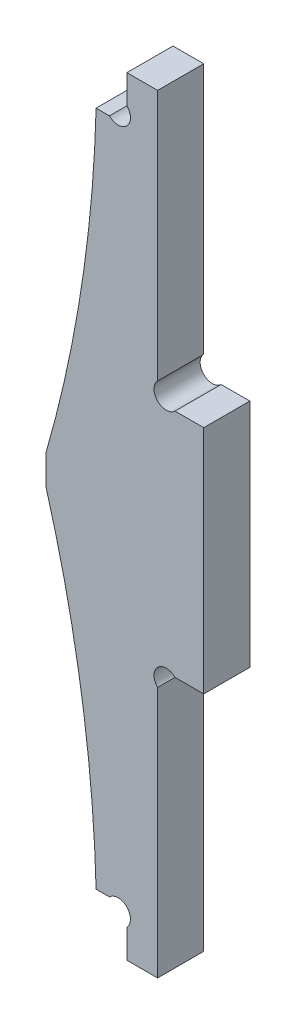
ISO-10303-21;
HEADER;
FILE_DESCRIPTION(('STEP AP214'),'2;1');
FILE_NAME('part.step','',(''),(''),'','','');
FILE_SCHEMA(('AUTOMOTIVE_DESIGN { 1 0 10303 214 1 1 1 1 }'));
ENDSEC;
DATA;
#1=APPLICATION_CONTEXT('core data for automotive mechanical design processes');
#2=APPLICATION_PROTOCOL_DEFINITION('international standard','automotive_design',2000,#1);
#3=PRODUCT_CONTEXT('',#1,'mechanical');
#4=PRODUCT('Part','Part','',(#3));
#5=PRODUCT_RELATED_PRODUCT_CATEGORY('part','',(#4));
#6=PRODUCT_DEFINITION_FORMATION('','',#4);
#7=PRODUCT_DEFINITION_CONTEXT('part definition',#1,'design');
#8=PRODUCT_DEFINITION('design','',#6,#7);
#9=PRODUCT_DEFINITION_SHAPE('','',#8);
#10=(LENGTH_UNIT() NAMED_UNIT(*) SI_UNIT(.MILLI.,.METRE.));
#11=(NAMED_UNIT(*) PLANE_ANGLE_UNIT() SI_UNIT($,.RADIAN.));
#12=(NAMED_UNIT(*) SI_UNIT($,.STERADIAN.) SOLID_ANGLE_UNIT());
#13=UNCERTAINTY_MEASURE_WITH_UNIT(LENGTH_MEASURE(1.E-05),#10,'distance_accuracy_value','');
#14=(GEOMETRIC_REPRESENTATION_CONTEXT(3) GLOBAL_UNCERTAINTY_ASSIGNED_CONTEXT((#13)) GLOBAL_UNIT_ASSIGNED_CONTEXT((#10,
#11,#12)) REPRESENTATION_CONTEXT('',''));
#15=CARTESIAN_POINT('',(0.,0.,0.));
#16=DIRECTION('',(0.,0.,1.));
#17=DIRECTION('',(1.,0.,0.));
#18=AXIS2_PLACEMENT_3D('',#15,#16,#17);
#19=CARTESIAN_POINT('',(-5.13137084989823,4.86862915010128,6.));
#20=DIRECTION('',(0.,0.,-1.));
#21=DIRECTION('',(-1.,0.,0.));
#22=AXIS2_PLACEMENT_3D('',#19,#20,#21);
#23=CYLINDRICAL_SURFACE('',#22,1.59999999999985);
#24=CARTESIAN_POINT('',(-5.13137084989823,4.86862915010128,0.));
#25=DIRECTION('',(0.,0.,-1.));
#26=DIRECTION('',(1.,0.,0.));
#27=AXIS2_PLACEMENT_3D('',#24,#25,#26);
#28=CIRCLE('',#27,1.59999999999985);
#29=CARTESIAN_POINT('',(-6.26274169979625,6.,0.));
#30=VERTEX_POINT('',#29);
#31=CARTESIAN_POINT('',(-4.,3.73725830020277,0.));
#32=VERTEX_POINT('',#31);
#33=EDGE_CURVE('E154',#30,#32,#28,.T.);
#34=ORIENTED_EDGE('',*,*,#33,.T.);
#35=DIRECTION('',(0.,0.,-1.));
#36=VECTOR('',#35,1.);
#37=CARTESIAN_POINT('',(-4.,3.73725830020277,6.));
#38=LINE('',#37,#36);
#39=CARTESIAN_POINT('',(-4.,3.73725830020277,6.));
#40=VERTEX_POINT('',#39);
#41=EDGE_CURVE('E11',#40,#32,#38,.T.);
#42=ORIENTED_EDGE('',*,*,#41,.F.);
#43=CARTESIAN_POINT('',(-5.13137084989823,4.86862915010128,6.));
#44=DIRECTION('',(0.,0.,-1.));
#45=DIRECTION('',(1.,0.,0.));
#46=AXIS2_PLACEMENT_3D('',#43,#44,#45);
#47=CIRCLE('',#46,1.59999999999985);
#48=CARTESIAN_POINT('',(-6.26274169979625,6.,6.));
#49=VERTEX_POINT('',#48);
#50=EDGE_CURVE('E201',#49,#40,#47,.T.);
#51=ORIENTED_EDGE('',*,*,#50,.F.);
#52=DIRECTION('',(0.,0.,-1.));
#53=VECTOR('',#52,1.);
#54=CARTESIAN_POINT('',(-6.26274169979625,6.,6.));
#55=LINE('',#54,#53);
#56=EDGE_CURVE('E167',#49,#30,#55,.T.);
#57=ORIENTED_EDGE('',*,*,#56,.T.);
#58=EDGE_LOOP('',(#34,#42,#51,#57));
#59=FACE_BOUND('',#58,.T.);
#60=ADVANCED_FACE('F26',(#59),#23,.F.);
#61=CARTESIAN_POINT('',(-4.,3.73725830020277,6.));
#62=DIRECTION('',(1.,0.,0.));
#63=DIRECTION('',(0.,1.,0.));
#64=AXIS2_PLACEMENT_3D('',#61,#62,#63);
#65=PLANE('',#64);
#66=DIRECTION('',(0.,-1.,0.));
#67=VECTOR('',#66,1.);
#68=CARTESIAN_POINT('',(-4.,3.73725830020277,0.));
#69=LINE('',#68,#67);
#70=CARTESIAN_POINT('',(-3.99999999999975,0.,0.));
#71=VERTEX_POINT('',#70);
#72=EDGE_CURVE('E150',#32,#71,#69,.T.);
#73=ORIENTED_EDGE('',*,*,#72,.T.);
#74=DIRECTION('',(0.,0.,-1.));
#75=VECTOR('',#74,1.);
#76=CARTESIAN_POINT('',(-3.99999999999975,0.,6.));
#77=LINE('',#76,#75);
#78=CARTESIAN_POINT('',(-3.99999999999975,0.,6.));
#79=VERTEX_POINT('',#78);
#80=EDGE_CURVE('E33',#79,#71,#77,.T.);
#81=ORIENTED_EDGE('',*,*,#80,.F.);
#82=DIRECTION('',(0.,-1.,0.));
#83=VECTOR('',#82,1.);
#84=CARTESIAN_POINT('',(-4.,3.73725830020277,6.));
#85=LINE('',#84,#83);
#86=EDGE_CURVE('E163',#40,#79,#85,.T.);
#87=ORIENTED_EDGE('',*,*,#86,.F.);
#88=ORIENTED_EDGE('',*,*,#41,.T.);
#89=EDGE_LOOP('',(#73,#81,#87,#88));
#90=FACE_BOUND('',#89,.T.);
#91=ADVANCED_FACE('F162',(#90),#65,.F.);
#92=CARTESIAN_POINT('',(-3.99999999999975,0.,6.));
#93=DIRECTION('',(0.,1.,0.));
#94=DIRECTION('',(-1.,0.,0.));
#95=AXIS2_PLACEMENT_3D('',#92,#93,#94);
#96=PLANE('',#95);
#97=DIRECTION('',(1.,0.,0.));
#98=VECTOR('',#97,1.);
#99=CARTESIAN_POINT('',(-3.99999999999975,0.,0.));
#100=LINE('',#99,#98);
#101=CARTESIAN_POINT('',(2.56374329118909E-13,0.,0.));
#102=VERTEX_POINT('',#101);
#103=EDGE_CURVE('E156',#71,#102,#100,.T.);
#104=ORIENTED_EDGE('',*,*,#103,.T.);
#105=DIRECTION('',(0.,0.,-1.));
#106=VECTOR('',#105,1.);
#107=CARTESIAN_POINT('',(2.56374329118909E-13,0.,6.));
#108=LINE('',#107,#106);
#109=CARTESIAN_POINT('',(2.56374329118909E-13,0.,6.));
#110=VERTEX_POINT('',#109);
#111=EDGE_CURVE('E277',#110,#102,#108,.T.);
#112=ORIENTED_EDGE('',*,*,#111,.F.);
#113=DIRECTION('',(1.,0.,0.));
#114=VECTOR('',#113,1.);
#115=CARTESIAN_POINT('',(-3.99999999999975,0.,6.));
#116=LINE('',#115,#114);
#117=EDGE_CURVE('E204',#79,#110,#116,.T.);
#118=ORIENTED_EDGE('',*,*,#117,.F.);
#119=ORIENTED_EDGE('',*,*,#80,.T.);
#120=EDGE_LOOP('',(#104,#112,#118,#119));
#121=FACE_BOUND('',#120,.T.);
#122=ADVANCED_FACE('F281',(#121),#96,.F.);
#123=CARTESIAN_POINT('',(0.,32.7372583002032,6.));
#124=DIRECTION('',(-1.,0.,0.));
#125=DIRECTION('',(0.,-1.,0.));
#126=AXIS2_PLACEMENT_3D('',#123,#124,#125);
#127=PLANE('',#126);
#128=DIRECTION('',(0.,1.,0.));
#129=VECTOR('',#128,1.);
#130=CARTESIAN_POINT('',(0.,32.7372583002032,0.));
#131=LINE('',#130,#129);
#132=CARTESIAN_POINT('',(0.,32.7372583002031,0.));
#133=VERTEX_POINT('',#132);
#134=EDGE_CURVE('E171',#102,#133,#131,.T.);
#135=ORIENTED_EDGE('',*,*,#134,.T.);
#136=DIRECTION('',(0.,0.,-1.));
#137=VECTOR('',#136,1.);
#138=CARTESIAN_POINT('',(0.,32.7372583002031,6.));
#139=LINE('',#138,#137);
#140=CARTESIAN_POINT('',(0.,32.7372583002031,6.));
#141=VERTEX_POINT('',#140);
#142=EDGE_CURVE('E274',#141,#133,#139,.T.);
#143=ORIENTED_EDGE('',*,*,#142,.F.);
#144=DIRECTION('',(0.,1.,0.));
#145=VECTOR('',#144,1.);
#146=CARTESIAN_POINT('',(0.,32.7372583002032,6.));
#147=LINE('',#146,#145);
#148=EDGE_CURVE('E206',#110,#141,#147,.T.);
#149=ORIENTED_EDGE('',*,*,#148,.F.);
#150=ORIENTED_EDGE('',*,*,#111,.T.);
#151=EDGE_LOOP('',(#135,#143,#149,#150));
#152=FACE_BOUND('',#151,.T.);
#153=ADVANCED_FACE('F289',(#152),#127,.F.);
#154=CARTESIAN_POINT('',(1.1313708498985,33.8686291501015,6.));
#155=DIRECTION('',(0.,0.,-1.));
#156=DIRECTION('',(-1.,0.,0.));
#157=AXIS2_PLACEMENT_3D('',#154,#155,#156);
#158=CYLINDRICAL_SURFACE('',#157,1.59999999999995);
#159=CARTESIAN_POINT('',(1.1313708498985,33.8686291501015,0.));
#160=DIRECTION('',(0.,0.,-1.));
#161=DIRECTION('',(1.,0.,0.));
#162=AXIS2_PLACEMENT_3D('',#159,#160,#161);
#163=CIRCLE('',#162,1.59999999999995);
#164=CARTESIAN_POINT('',(2.26274169979699,35.,0.));
#165=VERTEX_POINT('',#164);
#166=EDGE_CURVE('E173',#133,#165,#163,.T.);
#167=ORIENTED_EDGE('',*,*,#166,.T.);
#168=DIRECTION('',(0.,0.,-1.));
#169=VECTOR('',#168,1.);
#170=CARTESIAN_POINT('',(2.26274169979699,35.,6.));
#171=LINE('',#170,#169);
#172=CARTESIAN_POINT('',(2.26274169979699,35.,6.));
#173=VERTEX_POINT('',#172);
#174=EDGE_CURVE('E271',#173,#165,#171,.T.);
#175=ORIENTED_EDGE('',*,*,#174,.F.);
#176=CARTESIAN_POINT('',(1.1313708498985,33.8686291501015,6.));
#177=DIRECTION('',(0.,0.,-1.));
#178=DIRECTION('',(1.,0.,0.));
#179=AXIS2_PLACEMENT_3D('',#176,#177,#178);
#180=CIRCLE('',#179,1.59999999999995);
#181=EDGE_CURVE('E208',#141,#173,#180,.T.);
#182=ORIENTED_EDGE('',*,*,#181,.F.);
#183=ORIENTED_EDGE('',*,*,#142,.T.);
#184=EDGE_LOOP('',(#167,#175,#182,#183));
#185=FACE_BOUND('',#184,.T.);
#186=ADVANCED_FACE('F292',(#185),#158,.F.);
#187=CARTESIAN_POINT('',(2.26274169979699,35.,6.));
#188=DIRECTION('',(0.,1.,0.));
#189=DIRECTION('',(0.,0.,1.));
#190=AXIS2_PLACEMENT_3D('',#187,#188,#189);
#191=PLANE('',#190);
#192=DIRECTION('',(1.,0.,0.));
#193=VECTOR('',#192,1.);
#194=CARTESIAN_POINT('',(2.26274169979699,35.,0.));
#195=LINE('',#194,#193);
#196=CARTESIAN_POINT('',(6.,35.,0.));
#197=VERTEX_POINT('',#196);
#198=EDGE_CURVE('E175',#165,#197,#195,.T.);
#199=ORIENTED_EDGE('',*,*,#198,.T.);
#200=DIRECTION('',(0.,0.,-1.));
#201=VECTOR('',#200,1.);
#202=CARTESIAN_POINT('',(6.,35.,6.));
#203=LINE('',#202,#201);
#204=CARTESIAN_POINT('',(6.,35.,6.));
#205=VERTEX_POINT('',#204);
#206=EDGE_CURVE('E268',#205,#197,#203,.T.);
#207=ORIENTED_EDGE('',*,*,#206,.F.);
#208=DIRECTION('',(1.,0.,0.));
#209=VECTOR('',#208,1.);
#210=CARTESIAN_POINT('',(2.26274169979699,35.,6.));
#211=LINE('',#210,#209);
#212=EDGE_CURVE('E210',#173,#205,#211,.T.);
#213=ORIENTED_EDGE('',*,*,#212,.F.);
#214=ORIENTED_EDGE('',*,*,#174,.T.);
#215=EDGE_LOOP('',(#199,#207,#213,#214));
#216=FACE_BOUND('',#215,.T.);
#217=ADVANCED_FACE('F297',(#216),#191,.F.);
#218=CARTESIAN_POINT('',(6.,65.,6.));
#219=DIRECTION('',(-1.,0.,0.));
#220=DIRECTION('',(0.,0.,1.));
#221=AXIS2_PLACEMENT_3D('',#218,#219,#220);
#222=PLANE('',#221);
#223=DIRECTION('',(0.,1.,0.));
#224=VECTOR('',#223,1.);
#225=CARTESIAN_POINT('',(6.,65.,0.));
#226=LINE('',#225,#224);
#227=CARTESIAN_POINT('',(6.,65.,0.));
#228=VERTEX_POINT('',#227);
#229=EDGE_CURVE('E177',#197,#228,#226,.T.);
#230=ORIENTED_EDGE('',*,*,#229,.T.);
#231=DIRECTION('',(0.,0.,-1.));
#232=VECTOR('',#231,1.);
#233=CARTESIAN_POINT('',(6.,65.,6.));
#234=LINE('',#233,#232);
#235=CARTESIAN_POINT('',(6.,65.,6.));
#236=VERTEX_POINT('',#235);
#237=EDGE_CURVE('E265',#236,#228,#234,.T.);
#238=ORIENTED_EDGE('',*,*,#237,.F.);
#239=DIRECTION('',(0.,1.,0.));
#240=VECTOR('',#239,1.);
#241=CARTESIAN_POINT('',(6.,65.,6.));
#242=LINE('',#241,#240);
#243=EDGE_CURVE('E212',#205,#236,#242,.T.);
#244=ORIENTED_EDGE('',*,*,#243,.F.);
#245=ORIENTED_EDGE('',*,*,#206,.T.);
#246=EDGE_LOOP('',(#230,#238,#244,#245));
#247=FACE_BOUND('',#246,.T.);
#248=ADVANCED_FACE('F303',(#247),#222,.F.);
#249=CARTESIAN_POINT('',(2.26274169979699,65.,6.));
#250=DIRECTION('',(0.,-1.,0.));
#251=DIRECTION('',(0.,0.,-1.));
#252=AXIS2_PLACEMENT_3D('',#249,#250,#251);
#253=PLANE('',#252);
#254=DIRECTION('',(-1.,0.,0.));
#255=VECTOR('',#254,1.);
#256=CARTESIAN_POINT('',(2.26274169979699,65.,0.));
#257=LINE('',#256,#255);
#258=CARTESIAN_POINT('',(2.26274169979696,65.,0.));
#259=VERTEX_POINT('',#258);
#260=EDGE_CURVE('E179',#228,#259,#257,.T.);
#261=ORIENTED_EDGE('',*,*,#260,.T.);
#262=DIRECTION('',(0.,0.,-1.));
#263=VECTOR('',#262,1.);
#264=CARTESIAN_POINT('',(2.26274169979696,65.,6.));
#265=LINE('',#264,#263);
#266=CARTESIAN_POINT('',(2.26274169979696,65.,6.));
#267=VERTEX_POINT('',#266);
#268=EDGE_CURVE('E262',#267,#259,#265,.T.);
#269=ORIENTED_EDGE('',*,*,#268,.F.);
#270=DIRECTION('',(-1.,0.,0.));
#271=VECTOR('',#270,1.);
#272=CARTESIAN_POINT('',(2.26274169979699,65.,6.));
#273=LINE('',#272,#271);
#274=EDGE_CURVE('E214',#236,#267,#273,.T.);
#275=ORIENTED_EDGE('',*,*,#274,.F.);
#276=ORIENTED_EDGE('',*,*,#237,.T.);
#277=EDGE_LOOP('',(#261,#269,#275,#276));
#278=FACE_BOUND('',#277,.T.);
#279=ADVANCED_FACE('F307',(#278),#253,.F.);
#280=CARTESIAN_POINT('',(1.1313708498985,66.1313708498984,6.));
#281=DIRECTION('',(0.,0.,-1.));
#282=DIRECTION('',(-1.,0.,0.));
#283=AXIS2_PLACEMENT_3D('',#280,#281,#282);
#284=CYLINDRICAL_SURFACE('',#283,1.59999999999995);
#285=CARTESIAN_POINT('',(1.1313708498985,66.1313708498984,0.));
#286=DIRECTION('',(0.,0.,-1.));
#287=DIRECTION('',(-1.,0.,0.));
#288=AXIS2_PLACEMENT_3D('',#285,#286,#287);
#289=CIRCLE('',#288,1.59999999999995);
#290=CARTESIAN_POINT('',(0.,67.2627416997968,0.));
#291=VERTEX_POINT('',#290);
#292=EDGE_CURVE('E181',#259,#291,#289,.T.);
#293=ORIENTED_EDGE('',*,*,#292,.T.);
#294=DIRECTION('',(0.,0.,-1.));
#295=VECTOR('',#294,1.);
#296=CARTESIAN_POINT('',(0.,67.2627416997968,6.));
#297=LINE('',#296,#295);
#298=CARTESIAN_POINT('',(0.,67.2627416997968,6.));
#299=VERTEX_POINT('',#298);
#300=EDGE_CURVE('E259',#299,#291,#297,.T.);
#301=ORIENTED_EDGE('',*,*,#300,.F.);
#302=CARTESIAN_POINT('',(1.1313708498985,66.1313708498984,6.));
#303=DIRECTION('',(0.,0.,-1.));
#304=DIRECTION('',(-1.,0.,0.));
#305=AXIS2_PLACEMENT_3D('',#302,#303,#304);
#306=CIRCLE('',#305,1.59999999999995);
#307=EDGE_CURVE('E216',#267,#299,#306,.T.);
#308=ORIENTED_EDGE('',*,*,#307,.F.);
#309=ORIENTED_EDGE('',*,*,#268,.T.);
#310=EDGE_LOOP('',(#293,#301,#308,#309));
#311=FACE_BOUND('',#310,.T.);
#312=ADVANCED_FACE('F312',(#311),#284,.F.);
#313=CARTESIAN_POINT('',(0.,67.2627416997968,6.));
#314=DIRECTION('',(-1.,0.,0.));
#315=DIRECTION('',(0.,-1.,0.));
#316=AXIS2_PLACEMENT_3D('',#313,#314,#315);
#317=PLANE('',#316);
#318=DIRECTION('',(0.,1.,0.));
#319=VECTOR('',#318,1.);
#320=CARTESIAN_POINT('',(0.,67.2627416997968,0.));
#321=LINE('',#320,#319);
#322=CARTESIAN_POINT('',(2.56374329118909E-13,99.9999999999999,0.));
#323=VERTEX_POINT('',#322);
#324=EDGE_CURVE('E183',#291,#323,#321,.T.);
#325=ORIENTED_EDGE('',*,*,#324,.T.);
#326=DIRECTION('',(0.,0.,-1.));
#327=VECTOR('',#326,1.);
#328=CARTESIAN_POINT('',(2.56374329118909E-13,99.9999999999999,6.));
#329=LINE('',#328,#327);
#330=CARTESIAN_POINT('',(2.56374329118909E-13,99.9999999999999,6.));
#331=VERTEX_POINT('',#330);
#332=EDGE_CURVE('E256',#331,#323,#329,.T.);
#333=ORIENTED_EDGE('',*,*,#332,.F.);
#334=DIRECTION('',(0.,1.,0.));
#335=VECTOR('',#334,1.);
#336=CARTESIAN_POINT('',(0.,67.2627416997968,6.));
#337=LINE('',#336,#335);
#338=EDGE_CURVE('E218',#299,#331,#337,.T.);
#339=ORIENTED_EDGE('',*,*,#338,.F.);
#340=ORIENTED_EDGE('',*,*,#300,.T.);
#341=EDGE_LOOP('',(#325,#333,#339,#340));
#342=FACE_BOUND('',#341,.T.);
#343=ADVANCED_FACE('F318',(#342),#317,.F.);
#344=CARTESIAN_POINT('',(-3.99999999999975,100.,6.));
#345=DIRECTION('',(0.,-1.,0.));
#346=DIRECTION('',(1.,0.,0.));
#347=AXIS2_PLACEMENT_3D('',#344,#345,#346);
#348=PLANE('',#347);
#349=DIRECTION('',(-1.,0.,0.));
#350=VECTOR('',#349,1.);
#351=CARTESIAN_POINT('',(-3.99999999999975,100.,0.));
#352=LINE('',#351,#350);
#353=CARTESIAN_POINT('',(-3.99999999999975,100.,0.));
#354=VERTEX_POINT('',#353);
#355=EDGE_CURVE('E185',#323,#354,#352,.T.);
#356=ORIENTED_EDGE('',*,*,#355,.T.);
#357=DIRECTION('',(0.,0.,-1.));
#358=VECTOR('',#357,1.);
#359=CARTESIAN_POINT('',(-3.99999999999975,100.,6.));
#360=LINE('',#359,#358);
#361=CARTESIAN_POINT('',(-3.99999999999975,100.,6.));
#362=VERTEX_POINT('',#361);
#363=EDGE_CURVE('E253',#362,#354,#360,.T.);
#364=ORIENTED_EDGE('',*,*,#363,.F.);
#365=DIRECTION('',(-1.,0.,0.));
#366=VECTOR('',#365,1.);
#367=CARTESIAN_POINT('',(-3.99999999999975,100.,6.));
#368=LINE('',#367,#366);
#369=EDGE_CURVE('E220',#331,#362,#368,.T.);
#370=ORIENTED_EDGE('',*,*,#369,.F.);
#371=ORIENTED_EDGE('',*,*,#332,.T.);
#372=EDGE_LOOP('',(#356,#364,#370,#371));
#373=FACE_BOUND('',#372,.T.);
#374=ADVANCED_FACE('F322',(#373),#348,.F.);
#375=CARTESIAN_POINT('',(-4.,96.2627416997972,6.));
#376=DIRECTION('',(1.,0.,0.));
#377=DIRECTION('',(0.,1.,0.));
#378=AXIS2_PLACEMENT_3D('',#375,#376,#377);
#379=PLANE('',#378);
#380=DIRECTION('',(0.,-1.,0.));
#381=VECTOR('',#380,1.);
#382=CARTESIAN_POINT('',(-4.,96.2627416997972,0.));
#383=LINE('',#382,#381);
#384=CARTESIAN_POINT('',(-4.,96.2627416997972,0.));
#385=VERTEX_POINT('',#384);
#386=EDGE_CURVE('E187',#354,#385,#383,.T.);
#387=ORIENTED_EDGE('',*,*,#386,.T.);
#388=DIRECTION('',(0.,0.,-1.));
#389=VECTOR('',#388,1.);
#390=CARTESIAN_POINT('',(-4.,96.2627416997972,6.));
#391=LINE('',#390,#389);
#392=CARTESIAN_POINT('',(-4.,96.2627416997972,6.));
#393=VERTEX_POINT('',#392);
#394=EDGE_CURVE('E250',#393,#385,#391,.T.);
#395=ORIENTED_EDGE('',*,*,#394,.F.);
#396=DIRECTION('',(0.,-1.,0.));
#397=VECTOR('',#396,1.);
#398=CARTESIAN_POINT('',(-4.,96.2627416997972,6.));
#399=LINE('',#398,#397);
#400=EDGE_CURVE('E222',#362,#393,#399,.T.);
#401=ORIENTED_EDGE('',*,*,#400,.F.);
#402=ORIENTED_EDGE('',*,*,#363,.T.);
#403=EDGE_LOOP('',(#387,#395,#401,#402));
#404=FACE_BOUND('',#403,.T.);
#405=ADVANCED_FACE('F327',(#404),#379,.F.);
#406=CARTESIAN_POINT('',(-5.13137084989823,95.1313708498987,6.));
#407=DIRECTION('',(0.,0.,-1.));
#408=DIRECTION('',(-1.,0.,0.));
#409=AXIS2_PLACEMENT_3D('',#406,#407,#408);
#410=CYLINDRICAL_SURFACE('',#409,1.59999999999984);
#411=CARTESIAN_POINT('',(-5.13137084989823,95.1313708498987,0.));
#412=DIRECTION('',(0.,0.,-1.));
#413=DIRECTION('',(-1.,0.,0.));
#414=AXIS2_PLACEMENT_3D('',#411,#412,#413);
#415=CIRCLE('',#414,1.59999999999984);
#416=CARTESIAN_POINT('',(-6.26274169979625,94.,0.));
#417=VERTEX_POINT('',#416);
#418=EDGE_CURVE('E189',#385,#417,#415,.T.);
#419=ORIENTED_EDGE('',*,*,#418,.T.);
#420=DIRECTION('',(0.,0.,-1.));
#421=VECTOR('',#420,1.);
#422=CARTESIAN_POINT('',(-6.26274169979625,94.,6.));
#423=LINE('',#422,#421);
#424=CARTESIAN_POINT('',(-6.26274169979625,94.,6.));
#425=VERTEX_POINT('',#424);
#426=EDGE_CURVE('E247',#425,#417,#423,.T.);
#427=ORIENTED_EDGE('',*,*,#426,.F.);
#428=CARTESIAN_POINT('',(-5.13137084989823,95.1313708498987,6.));
#429=DIRECTION('',(0.,0.,-1.));
#430=DIRECTION('',(-1.,0.,0.));
#431=AXIS2_PLACEMENT_3D('',#428,#429,#430);
#432=CIRCLE('',#431,1.59999999999984);
#433=EDGE_CURVE('E224',#393,#425,#432,.T.);
#434=ORIENTED_EDGE('',*,*,#433,.F.);
#435=ORIENTED_EDGE('',*,*,#394,.T.);
#436=EDGE_LOOP('',(#419,#427,#434,#435));
#437=FACE_BOUND('',#436,.T.);
#438=ADVANCED_FACE('F333',(#437),#410,.F.);
#439=CARTESIAN_POINT('',(-8.,94.,6.));
#440=DIRECTION('',(0.,-1.,0.));
#441=DIRECTION('',(0.,0.,-1.));
#442=AXIS2_PLACEMENT_3D('',#439,#440,#441);
#443=PLANE('',#442);
#444=DIRECTION('',(-1.,0.,0.));
#445=VECTOR('',#444,1.);
#446=CARTESIAN_POINT('',(-8.,94.,0.));
#447=LINE('',#446,#445);
#448=CARTESIAN_POINT('',(-8.00000000000001,94.,0.));
#449=VERTEX_POINT('',#448);
#450=EDGE_CURVE('E191',#417,#449,#447,.T.);
#451=ORIENTED_EDGE('',*,*,#450,.T.);
#452=DIRECTION('',(0.,0.,-1.));
#453=VECTOR('',#452,1.);
#454=CARTESIAN_POINT('',(-8.00000000000001,94.,6.));
#455=LINE('',#454,#453);
#456=CARTESIAN_POINT('',(-8.00000000000001,94.,6.));
#457=VERTEX_POINT('',#456);
#458=EDGE_CURVE('E244',#457,#449,#455,.T.);
#459=ORIENTED_EDGE('',*,*,#458,.F.);
#460=DIRECTION('',(-1.,0.,0.));
#461=VECTOR('',#460,1.);
#462=CARTESIAN_POINT('',(-8.,94.,6.));
#463=LINE('',#462,#461);
#464=EDGE_CURVE('E226',#425,#457,#463,.T.);
#465=ORIENTED_EDGE('',*,*,#464,.F.);
#466=ORIENTED_EDGE('',*,*,#426,.T.);
#467=EDGE_LOOP('',(#451,#459,#465,#466));
#468=FACE_BOUND('',#467,.T.);
#469=ADVANCED_FACE('F337',(#468),#443,.F.);
#470=CARTESIAN_POINT('',(-176.387816866661,98.557043086507,6.));
#471=DIRECTION('',(0.,0.,-1.));
#472=DIRECTION('',(-1.,0.,0.));
#473=AXIS2_PLACEMENT_3D('',#470,#471,#472);
#474=CYLINDRICAL_SURFACE('',#473,168.449468716326);
#475=CARTESIAN_POINT('',(-176.387816866661,98.557043086507,0.));
#476=DIRECTION('',(0.,0.,-1.));
#477=DIRECTION('',(1.,0.,0.));
#478=AXIS2_PLACEMENT_3D('',#475,#476,#477);
#479=CIRCLE('',#478,168.449468716326);
#480=CARTESIAN_POINT('',(-14.5,52.,0.));
#481=VERTEX_POINT('',#480);
#482=EDGE_CURVE('E193',#449,#481,#479,.T.);
#483=ORIENTED_EDGE('',*,*,#482,.T.);
#484=DIRECTION('',(0.,0.,-1.));
#485=VECTOR('',#484,1.);
#486=CARTESIAN_POINT('',(-14.5,52.,6.));
#487=LINE('',#486,#485);
#488=CARTESIAN_POINT('',(-14.5,52.,6.));
#489=VERTEX_POINT('',#488);
#490=EDGE_CURVE('E241',#489,#481,#487,.T.);
#491=ORIENTED_EDGE('',*,*,#490,.F.);
#492=CARTESIAN_POINT('',(-176.387816866661,98.557043086507,6.));
#493=DIRECTION('',(0.,0.,-1.));
#494=DIRECTION('',(1.,0.,0.));
#495=AXIS2_PLACEMENT_3D('',#492,#493,#494);
#496=CIRCLE('',#495,168.449468716326);
#497=EDGE_CURVE('E228',#457,#489,#496,.T.);
#498=ORIENTED_EDGE('',*,*,#497,.F.);
#499=ORIENTED_EDGE('',*,*,#458,.T.);
#500=EDGE_LOOP('',(#483,#491,#498,#499));
#501=FACE_BOUND('',#500,.T.);
#502=ADVANCED_FACE('F342',(#501),#474,.F.);
#503=CARTESIAN_POINT('',(-14.5,52.,6.));
#504=DIRECTION('',(1.,0.,0.));
#505=DIRECTION('',(0.,0.,-1.));
#506=AXIS2_PLACEMENT_3D('',#503,#504,#505);
#507=PLANE('',#506);
#508=DIRECTION('',(0.,-1.,0.));
#509=VECTOR('',#508,1.);
#510=CARTESIAN_POINT('',(-14.5,52.,0.));
#511=LINE('',#510,#509);
#512=CARTESIAN_POINT('',(-14.5,48.,0.));
#513=VERTEX_POINT('',#512);
#514=EDGE_CURVE('E195',#481,#513,#511,.T.);
#515=ORIENTED_EDGE('',*,*,#514,.T.);
#516=DIRECTION('',(0.,0.,-1.));
#517=VECTOR('',#516,1.);
#518=CARTESIAN_POINT('',(-14.5,48.,6.));
#519=LINE('',#518,#517);
#520=CARTESIAN_POINT('',(-14.5,48.,6.));
#521=VERTEX_POINT('',#520);
#522=EDGE_CURVE('E238',#521,#513,#519,.T.);
#523=ORIENTED_EDGE('',*,*,#522,.F.);
#524=DIRECTION('',(0.,-1.,0.));
#525=VECTOR('',#524,1.);
#526=CARTESIAN_POINT('',(-14.5,52.,6.));
#527=LINE('',#526,#525);
#528=EDGE_CURVE('E230',#489,#521,#527,.T.);
#529=ORIENTED_EDGE('',*,*,#528,.F.);
#530=ORIENTED_EDGE('',*,*,#490,.T.);
#531=EDGE_LOOP('',(#515,#523,#529,#530));
#532=FACE_BOUND('',#531,.T.);
#533=ADVANCED_FACE('F346',(#532),#507,.F.);
#534=CARTESIAN_POINT('',(-176.387816866661,1.44295691349296,6.));
#535=DIRECTION('',(0.,0.,-1.));
#536=DIRECTION('',(-1.,0.,0.));
#537=AXIS2_PLACEMENT_3D('',#534,#535,#536);
#538=CYLINDRICAL_SURFACE('',#537,168.449468716326);
#539=CARTESIAN_POINT('',(-176.387816866661,1.44295691349296,0.));
#540=DIRECTION('',(0.,0.,-1.));
#541=DIRECTION('',(-1.,0.,0.));
#542=AXIS2_PLACEMENT_3D('',#539,#540,#541);
#543=CIRCLE('',#542,168.449468716326);
#544=CARTESIAN_POINT('',(-8.,6.,0.));
#545=VERTEX_POINT('',#544);
#546=EDGE_CURVE('E197',#513,#545,#543,.T.);
#547=ORIENTED_EDGE('',*,*,#546,.T.);
#548=DIRECTION('',(0.,0.,-1.));
#549=VECTOR('',#548,1.);
#550=CARTESIAN_POINT('',(-8.,6.,6.));
#551=LINE('',#550,#549);
#552=CARTESIAN_POINT('',(-8.,6.,6.));
#553=VERTEX_POINT('',#552);
#554=EDGE_CURVE('E235',#553,#545,#551,.T.);
#555=ORIENTED_EDGE('',*,*,#554,.F.);
#556=CARTESIAN_POINT('',(-176.387816866661,1.44295691349296,6.));
#557=DIRECTION('',(0.,0.,-1.));
#558=DIRECTION('',(-1.,0.,0.));
#559=AXIS2_PLACEMENT_3D('',#556,#557,#558);
#560=CIRCLE('',#559,168.449468716326);
#561=EDGE_CURVE('E45',#521,#553,#560,.T.);
#562=ORIENTED_EDGE('',*,*,#561,.F.);
#563=ORIENTED_EDGE('',*,*,#522,.T.);
#564=EDGE_LOOP('',(#547,#555,#562,#563));
#565=FACE_BOUND('',#564,.T.);
#566=ADVANCED_FACE('F350',(#565),#538,.F.);
#567=CARTESIAN_POINT('',(-8.,6.,6.));
#568=DIRECTION('',(0.,1.,0.));
#569=DIRECTION('',(-1.,0.,0.));
#570=AXIS2_PLACEMENT_3D('',#567,#568,#569);
#571=PLANE('',#570);
#572=DIRECTION('',(1.,0.,0.));
#573=VECTOR('',#572,1.);
#574=CARTESIAN_POINT('',(-8.,6.,0.));
#575=LINE('',#574,#573);
#576=EDGE_CURVE('E199',#545,#30,#575,.T.);
#577=ORIENTED_EDGE('',*,*,#576,.T.);
#578=ORIENTED_EDGE('',*,*,#56,.F.);
#579=DIRECTION('',(1.,0.,0.));
#580=VECTOR('',#579,1.);
#581=CARTESIAN_POINT('',(-8.,6.,6.));
#582=LINE('',#581,#580);
#583=EDGE_CURVE('E40',#553,#49,#582,.T.);
#584=ORIENTED_EDGE('',*,*,#583,.F.);
#585=ORIENTED_EDGE('',*,*,#554,.T.);
#586=EDGE_LOOP('',(#577,#578,#584,#585));
#587=FACE_BOUND('',#586,.T.);
#588=ADVANCED_FACE('F352',(#587),#571,.F.);
#589=CARTESIAN_POINT('',(-5.13137084989823,4.86862915010128,6.));
#590=DIRECTION('',(0.,0.,1.));
#591=DIRECTION('',(1.,0.,0.));
#592=AXIS2_PLACEMENT_3D('',#589,#590,#591);
#593=PLANE('',#592);
#594=ORIENTED_EDGE('',*,*,#50,.T.);
#595=ORIENTED_EDGE('',*,*,#86,.T.);
#596=ORIENTED_EDGE('',*,*,#117,.T.);
#597=ORIENTED_EDGE('',*,*,#148,.T.);
#598=ORIENTED_EDGE('',*,*,#181,.T.);
#599=ORIENTED_EDGE('',*,*,#212,.T.);
#600=ORIENTED_EDGE('',*,*,#243,.T.);
#601=ORIENTED_EDGE('',*,*,#274,.T.);
#602=ORIENTED_EDGE('',*,*,#307,.T.);
#603=ORIENTED_EDGE('',*,*,#338,.T.);
#604=ORIENTED_EDGE('',*,*,#369,.T.);
#605=ORIENTED_EDGE('',*,*,#400,.T.);
#606=ORIENTED_EDGE('',*,*,#433,.T.);
#607=ORIENTED_EDGE('',*,*,#464,.T.);
#608=ORIENTED_EDGE('',*,*,#497,.T.);
#609=ORIENTED_EDGE('',*,*,#528,.T.);
#610=ORIENTED_EDGE('',*,*,#561,.T.);
#611=ORIENTED_EDGE('',*,*,#583,.T.);
#612=EDGE_LOOP('',(#594,#595,#596,#597,#598,#599,#600,#601,#602,#603,#604,#605,#606,#607,#608,
#609,#610,#611));
#613=FACE_BOUND('',#612,.T.);
#614=ADVANCED_FACE('F284',(#613),#593,.T.);
#615=CARTESIAN_POINT('',(-5.13137084989823,4.86862915010128,0.));
#616=DIRECTION('',(0.,0.,1.));
#617=DIRECTION('',(1.,0.,0.));
#618=AXIS2_PLACEMENT_3D('',#615,#616,#617);
#619=PLANE('',#618);
#620=ORIENTED_EDGE('',*,*,#33,.F.);
#621=ORIENTED_EDGE('',*,*,#576,.F.);
#622=ORIENTED_EDGE('',*,*,#546,.F.);
#623=ORIENTED_EDGE('',*,*,#514,.F.);
#624=ORIENTED_EDGE('',*,*,#482,.F.);
#625=ORIENTED_EDGE('',*,*,#450,.F.);
#626=ORIENTED_EDGE('',*,*,#418,.F.);
#627=ORIENTED_EDGE('',*,*,#386,.F.);
#628=ORIENTED_EDGE('',*,*,#355,.F.);
#629=ORIENTED_EDGE('',*,*,#324,.F.);
#630=ORIENTED_EDGE('',*,*,#292,.F.);
#631=ORIENTED_EDGE('',*,*,#260,.F.);
#632=ORIENTED_EDGE('',*,*,#229,.F.);
#633=ORIENTED_EDGE('',*,*,#198,.F.);
#634=ORIENTED_EDGE('',*,*,#166,.F.);
#635=ORIENTED_EDGE('',*,*,#134,.F.);
#636=ORIENTED_EDGE('',*,*,#103,.F.);
#637=ORIENTED_EDGE('',*,*,#72,.F.);
#638=EDGE_LOOP('',(#620,#621,#622,#623,#624,#625,#626,#627,#628,#629,#630,#631,#632,#633,#634,
#635,#636,#637));
#639=FACE_BOUND('',#638,.T.);
#640=ADVANCED_FACE('F151',(#639),#619,.F.);
#641=CLOSED_SHELL('',(#60,#91,#122,#153,#186,#217,#248,#279,#312,#343,#374,#405,#438,#469,#502,
#533,#566,#588,#614,#640));
#642=MANIFOLD_SOLID_BREP('B2',#641);
#643=ADVANCED_BREP_SHAPE_REPRESENTATION('',(#18,#642),#14);
#644=SHAPE_DEFINITION_REPRESENTATION(#9,#643);
ENDSEC;
END-ISO-10303-21;
